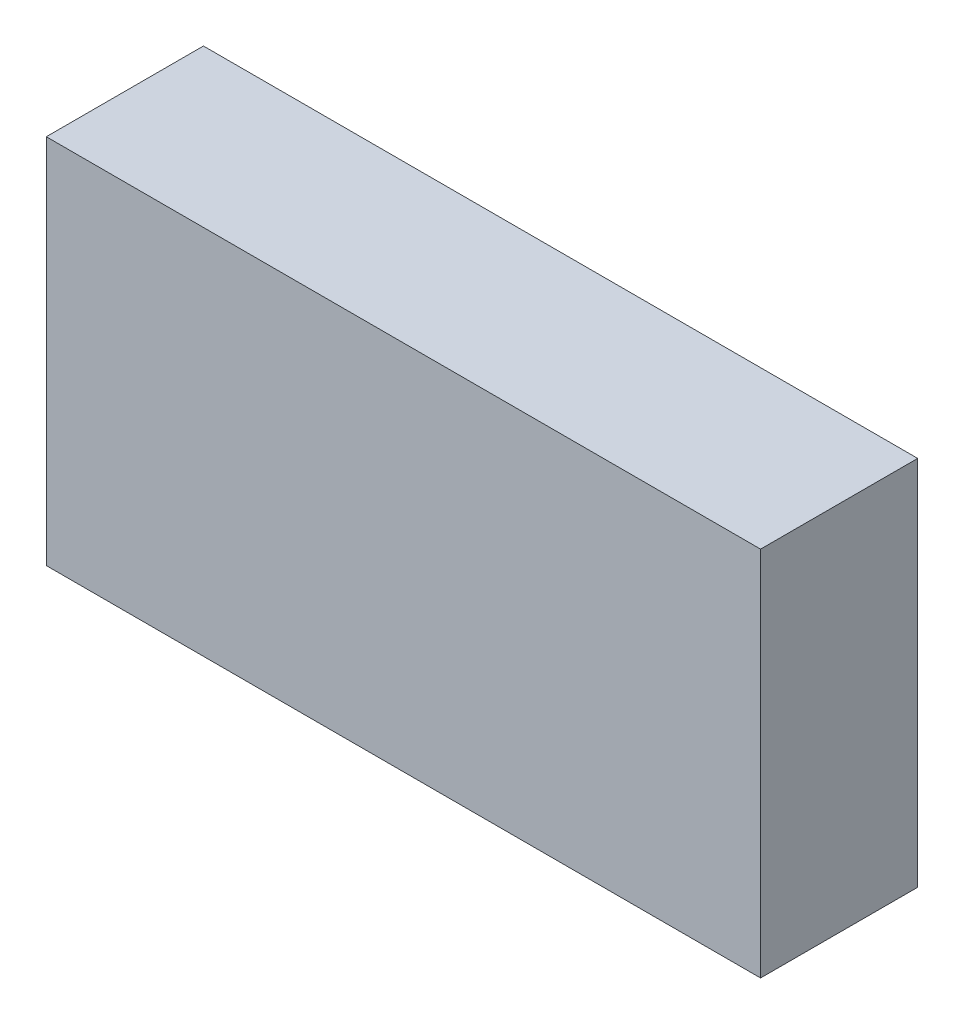
ISO-10303-21;
HEADER;
FILE_DESCRIPTION(('STEP AP214'),'2;1');
FILE_NAME('part.step','',(''),(''),'','','');
FILE_SCHEMA(('AUTOMOTIVE_DESIGN { 1 0 10303 214 1 1 1 1 }'));
ENDSEC;
DATA;
#1=APPLICATION_CONTEXT('core data for automotive mechanical design processes');
#2=APPLICATION_PROTOCOL_DEFINITION('international standard','automotive_design',2000,#1);
#3=PRODUCT_CONTEXT('',#1,'mechanical');
#4=PRODUCT('Part','Part','',(#3));
#5=PRODUCT_RELATED_PRODUCT_CATEGORY('part','',(#4));
#6=PRODUCT_DEFINITION_FORMATION('','',#4);
#7=PRODUCT_DEFINITION_CONTEXT('part definition',#1,'design');
#8=PRODUCT_DEFINITION('design','',#6,#7);
#9=PRODUCT_DEFINITION_SHAPE('','',#8);
#10=(LENGTH_UNIT() NAMED_UNIT(*) SI_UNIT(.MILLI.,.METRE.));
#11=(NAMED_UNIT(*) PLANE_ANGLE_UNIT() SI_UNIT($,.RADIAN.));
#12=(NAMED_UNIT(*) SI_UNIT($,.STERADIAN.) SOLID_ANGLE_UNIT());
#13=UNCERTAINTY_MEASURE_WITH_UNIT(LENGTH_MEASURE(1.E-05),#10,'distance_accuracy_value','');
#14=(GEOMETRIC_REPRESENTATION_CONTEXT(3) GLOBAL_UNCERTAINTY_ASSIGNED_CONTEXT((#13)) GLOBAL_UNIT_ASSIGNED_CONTEXT((#10,
#11,#12)) REPRESENTATION_CONTEXT('',''));
#15=CARTESIAN_POINT('',(0.,0.,0.));
#16=DIRECTION('',(0.,0.,1.));
#17=DIRECTION('',(1.,0.,0.));
#18=AXIS2_PLACEMENT_3D('',#15,#16,#17);
#19=CARTESIAN_POINT('',(36.5727369155721,66.6343036797774,11.));
#20=DIRECTION('',(-1.,0.,0.));
#21=DIRECTION('',(0.,-1.,0.));
#22=AXIS2_PLACEMENT_3D('',#19,#20,#21);
#23=PLANE('',#22);
#24=DIRECTION('',(0.,1.,0.));
#25=VECTOR('',#24,1.);
#26=CARTESIAN_POINT('',(36.5727369155721,66.6343036797774,0.));
#27=LINE('',#26,#25);
#28=CARTESIAN_POINT('',(36.5727369155721,40.6343036797774,0.));
#29=VERTEX_POINT('',#28);
#30=CARTESIAN_POINT('',(36.5727369155721,66.6343036797774,0.));
#31=VERTEX_POINT('',#30);
#32=EDGE_CURVE('E96',#29,#31,#27,.T.);
#33=ORIENTED_EDGE('',*,*,#32,.T.);
#34=DIRECTION('',(0.,0.,-1.));
#35=VECTOR('',#34,1.);
#36=CARTESIAN_POINT('',(36.5727369155721,66.6343036797774,11.));
#37=LINE('',#36,#35);
#38=CARTESIAN_POINT('',(36.5727369155721,66.6343036797774,11.));
#39=VERTEX_POINT('',#38);
#40=EDGE_CURVE('E11',#39,#31,#37,.T.);
#41=ORIENTED_EDGE('',*,*,#40,.F.);
#42=DIRECTION('',(0.,1.,0.));
#43=VECTOR('',#42,1.);
#44=CARTESIAN_POINT('',(36.5727369155721,66.6343036797774,11.));
#45=LINE('',#44,#43);
#46=CARTESIAN_POINT('',(36.5727369155721,40.6343036797774,11.));
#47=VERTEX_POINT('',#46);
#48=EDGE_CURVE('E84',#47,#39,#45,.T.);
#49=ORIENTED_EDGE('',*,*,#48,.F.);
#50=DIRECTION('',(0.,0.,-1.));
#51=VECTOR('',#50,1.);
#52=CARTESIAN_POINT('',(36.5727369155721,40.6343036797774,11.));
#53=LINE('',#52,#51);
#54=EDGE_CURVE('E92',#47,#29,#53,.T.);
#55=ORIENTED_EDGE('',*,*,#54,.T.);
#56=EDGE_LOOP('',(#33,#41,#49,#55));
#57=FACE_BOUND('',#56,.T.);
#58=ADVANCED_FACE('F33',(#57),#23,.F.);
#59=CARTESIAN_POINT('',(36.5727369155721,66.6343036797774,11.));
#60=DIRECTION('',(0.,-1.,0.));
#61=DIRECTION('',(1.,0.,0.));
#62=AXIS2_PLACEMENT_3D('',#59,#60,#61);
#63=PLANE('',#62);
#64=DIRECTION('',(-1.,0.,0.));
#65=VECTOR('',#64,1.);
#66=CARTESIAN_POINT('',(36.5727369155721,66.6343036797774,0.));
#67=LINE('',#66,#65);
#68=CARTESIAN_POINT('',(-13.4272630844279,66.6343036797774,0.));
#69=VERTEX_POINT('',#68);
#70=EDGE_CURVE('E88',#31,#69,#67,.T.);
#71=ORIENTED_EDGE('',*,*,#70,.T.);
#72=DIRECTION('',(0.,0.,-1.));
#73=VECTOR('',#72,1.);
#74=CARTESIAN_POINT('',(-13.4272630844279,66.6343036797774,11.));
#75=LINE('',#74,#73);
#76=CARTESIAN_POINT('',(-13.4272630844279,66.6343036797774,11.));
#77=VERTEX_POINT('',#76);
#78=EDGE_CURVE('E41',#77,#69,#75,.T.);
#79=ORIENTED_EDGE('',*,*,#78,.F.);
#80=DIRECTION('',(-1.,0.,0.));
#81=VECTOR('',#80,1.);
#82=CARTESIAN_POINT('',(36.5727369155721,66.6343036797774,11.));
#83=LINE('',#82,#81);
#84=EDGE_CURVE('E79',#39,#77,#83,.T.);
#85=ORIENTED_EDGE('',*,*,#84,.F.);
#86=ORIENTED_EDGE('',*,*,#40,.T.);
#87=EDGE_LOOP('',(#71,#79,#85,#86));
#88=FACE_BOUND('',#87,.T.);
#89=ADVANCED_FACE('F87',(#88),#63,.F.);
#90=CARTESIAN_POINT('',(-13.4272630844279,66.6343036797774,11.));
#91=DIRECTION('',(1.,0.,0.));
#92=DIRECTION('',(0.,0.,-1.));
#93=AXIS2_PLACEMENT_3D('',#90,#91,#92);
#94=PLANE('',#93);
#95=DIRECTION('',(0.,-1.,0.));
#96=VECTOR('',#95,1.);
#97=CARTESIAN_POINT('',(-13.4272630844279,66.6343036797774,0.));
#98=LINE('',#97,#96);
#99=CARTESIAN_POINT('',(-13.4272630844279,40.6343036797774,0.));
#100=VERTEX_POINT('',#99);
#101=EDGE_CURVE('E66',#69,#100,#98,.T.);
#102=ORIENTED_EDGE('',*,*,#101,.T.);
#103=DIRECTION('',(0.,0.,-1.));
#104=VECTOR('',#103,1.);
#105=CARTESIAN_POINT('',(-13.4272630844279,40.6343036797774,11.));
#106=LINE('',#105,#104);
#107=CARTESIAN_POINT('',(-13.4272630844279,40.6343036797774,11.));
#108=VERTEX_POINT('',#107);
#109=EDGE_CURVE('E89',#108,#100,#106,.T.);
#110=ORIENTED_EDGE('',*,*,#109,.F.);
#111=DIRECTION('',(0.,-1.,0.));
#112=VECTOR('',#111,1.);
#113=CARTESIAN_POINT('',(-13.4272630844279,66.6343036797774,11.));
#114=LINE('',#113,#112);
#115=EDGE_CURVE('E82',#77,#108,#114,.T.);
#116=ORIENTED_EDGE('',*,*,#115,.F.);
#117=ORIENTED_EDGE('',*,*,#78,.T.);
#118=EDGE_LOOP('',(#102,#110,#116,#117));
#119=FACE_BOUND('',#118,.T.);
#120=ADVANCED_FACE('F90',(#119),#94,.F.);
#121=CARTESIAN_POINT('',(36.5727369155721,40.6343036797774,11.));
#122=DIRECTION('',(0.,1.,0.));
#123=DIRECTION('',(-1.,0.,0.));
#124=AXIS2_PLACEMENT_3D('',#121,#122,#123);
#125=PLANE('',#124);
#126=DIRECTION('',(1.,0.,0.));
#127=VECTOR('',#126,1.);
#128=CARTESIAN_POINT('',(36.5727369155721,40.6343036797774,0.));
#129=LINE('',#128,#127);
#130=EDGE_CURVE('E72',#100,#29,#129,.T.);
#131=ORIENTED_EDGE('',*,*,#130,.T.);
#132=ORIENTED_EDGE('',*,*,#54,.F.);
#133=DIRECTION('',(1.,0.,0.));
#134=VECTOR('',#133,1.);
#135=CARTESIAN_POINT('',(36.5727369155721,40.6343036797774,11.));
#136=LINE('',#135,#134);
#137=EDGE_CURVE('E49',#108,#47,#136,.T.);
#138=ORIENTED_EDGE('',*,*,#137,.F.);
#139=ORIENTED_EDGE('',*,*,#109,.T.);
#140=EDGE_LOOP('',(#131,#132,#138,#139));
#141=FACE_BOUND('',#140,.T.);
#142=ADVANCED_FACE('F103',(#141),#125,.F.);
#143=CARTESIAN_POINT('',(0.,0.,11.));
#144=DIRECTION('',(0.,0.,-1.));
#145=DIRECTION('',(-1.,0.,0.));
#146=AXIS2_PLACEMENT_3D('',#143,#144,#145);
#147=PLANE('',#146);
#148=ORIENTED_EDGE('',*,*,#48,.T.);
#149=ORIENTED_EDGE('',*,*,#84,.T.);
#150=ORIENTED_EDGE('',*,*,#115,.T.);
#151=ORIENTED_EDGE('',*,*,#137,.T.);
#152=EDGE_LOOP('',(#148,#149,#150,#151));
#153=FACE_BOUND('',#152,.T.);
#154=ADVANCED_FACE('F80',(#153),#147,.F.);
#155=CARTESIAN_POINT('',(0.,0.,0.));
#156=DIRECTION('',(0.,0.,-1.));
#157=DIRECTION('',(-1.,0.,0.));
#158=AXIS2_PLACEMENT_3D('',#155,#156,#157);
#159=PLANE('',#158);
#160=ORIENTED_EDGE('',*,*,#32,.F.);
#161=ORIENTED_EDGE('',*,*,#130,.F.);
#162=ORIENTED_EDGE('',*,*,#101,.F.);
#163=ORIENTED_EDGE('',*,*,#70,.F.);
#164=EDGE_LOOP('',(#160,#161,#162,#163));
#165=FACE_BOUND('',#164,.T.);
#166=ADVANCED_FACE('F106',(#165),#159,.T.);
#167=CLOSED_SHELL('',(#58,#89,#120,#142,#154,#166));
#168=MANIFOLD_SOLID_BREP('B2',#167);
#169=ADVANCED_BREP_SHAPE_REPRESENTATION('',(#18,#168),#14);
#170=SHAPE_DEFINITION_REPRESENTATION(#9,#169);
ENDSEC;
END-ISO-10303-21;
